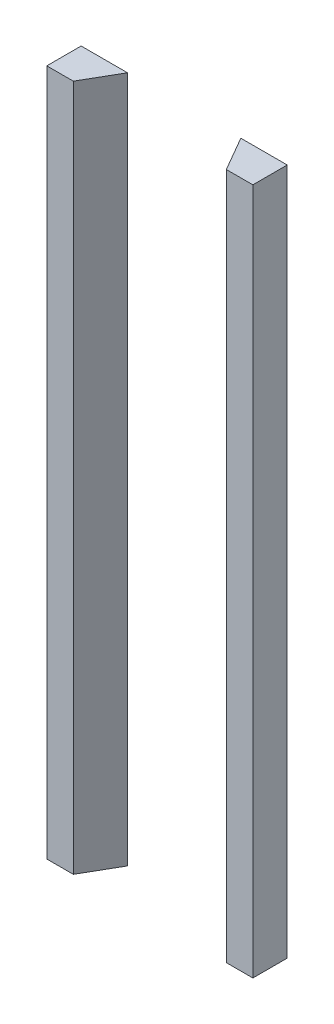
ISO-10303-21;
HEADER;
FILE_DESCRIPTION(('STEP AP214'),'2;1');
FILE_NAME('part.step','',(''),(''),'','','');
FILE_SCHEMA(('AUTOMOTIVE_DESIGN { 1 0 10303 214 1 1 1 1 }'));
ENDSEC;
DATA;
#1=APPLICATION_CONTEXT('core data for automotive mechanical design processes');
#2=APPLICATION_PROTOCOL_DEFINITION('international standard','automotive_design',2000,#1);
#3=PRODUCT_CONTEXT('',#1,'mechanical');
#4=PRODUCT('Part','Part','',(#3));
#5=PRODUCT_RELATED_PRODUCT_CATEGORY('part','',(#4));
#6=PRODUCT_DEFINITION_FORMATION('','',#4);
#7=PRODUCT_DEFINITION_CONTEXT('part definition',#1,'design');
#8=PRODUCT_DEFINITION('design','',#6,#7);
#9=PRODUCT_DEFINITION_SHAPE('','',#8);
#10=(LENGTH_UNIT() NAMED_UNIT(*) SI_UNIT(.MILLI.,.METRE.));
#11=(NAMED_UNIT(*) PLANE_ANGLE_UNIT() SI_UNIT($,.RADIAN.));
#12=(NAMED_UNIT(*) SI_UNIT($,.STERADIAN.) SOLID_ANGLE_UNIT());
#13=UNCERTAINTY_MEASURE_WITH_UNIT(LENGTH_MEASURE(1.E-05),#10,'distance_accuracy_value','');
#14=(GEOMETRIC_REPRESENTATION_CONTEXT(3) GLOBAL_UNCERTAINTY_ASSIGNED_CONTEXT((#13)) GLOBAL_UNIT_ASSIGNED_CONTEXT((#10,
#11,#12)) REPRESENTATION_CONTEXT('',''));
#15=CARTESIAN_POINT('',(0.,0.,0.));
#16=DIRECTION('',(0.,0.,1.));
#17=DIRECTION('',(1.,0.,0.));
#18=AXIS2_PLACEMENT_3D('',#15,#16,#17);
#19=CARTESIAN_POINT('',(-30.,200.,-4.99999999999999));
#20=DIRECTION('',(0.,0.,1.));
#21=DIRECTION('',(1.,0.,0.));
#22=AXIS2_PLACEMENT_3D('',#19,#20,#21);
#23=PLANE('',#22);
#24=DIRECTION('',(-1.,0.,0.));
#25=VECTOR('',#24,1.);
#26=CARTESIAN_POINT('',(-30.,200.,-4.99999999999999));
#27=LINE('',#26,#25);
#28=CARTESIAN_POINT('',(-16.5,200.,-4.99999999999999));
#29=VERTEX_POINT('',#28);
#30=CARTESIAN_POINT('',(-30.,200.,-4.99999999999999));
#31=VERTEX_POINT('',#30);
#32=EDGE_CURVE('E91',#29,#31,#27,.T.);
#33=ORIENTED_EDGE('',*,*,#32,.F.);
#34=DIRECTION('',(0.,1.,0.));
#35=VECTOR('',#34,1.);
#36=CARTESIAN_POINT('',(-16.5,-0.001000000000001,-4.99999999999999));
#37=LINE('',#36,#35);
#38=CARTESIAN_POINT('',(-16.5,0.,-4.99999999999999));
#39=VERTEX_POINT('',#38);
#40=EDGE_CURVE('E55',#39,#29,#37,.T.);
#41=ORIENTED_EDGE('',*,*,#40,.F.);
#42=DIRECTION('',(-1.,0.,0.));
#43=VECTOR('',#42,1.);
#44=CARTESIAN_POINT('',(-30.,0.,-4.99999999999999));
#45=LINE('',#44,#43);
#46=CARTESIAN_POINT('',(-30.,0.,-4.99999999999999));
#47=VERTEX_POINT('',#46);
#48=EDGE_CURVE('E49',#39,#47,#45,.T.);
#49=ORIENTED_EDGE('',*,*,#48,.T.);
#50=DIRECTION('',(0.,-1.,0.));
#51=VECTOR('',#50,1.);
#52=CARTESIAN_POINT('',(-30.,200.,-4.99999999999999));
#53=LINE('',#52,#51);
#54=EDGE_CURVE('E96',#31,#47,#53,.T.);
#55=ORIENTED_EDGE('',*,*,#54,.F.);
#56=EDGE_LOOP('',(#33,#41,#49,#55));
#57=FACE_BOUND('',#56,.T.);
#58=ADVANCED_FACE('F46',(#57),#23,.F.);
#59=CARTESIAN_POINT('',(-30.,200.,5.));
#60=DIRECTION('',(0.,0.,-1.));
#61=DIRECTION('',(-1.,0.,0.));
#62=AXIS2_PLACEMENT_3D('',#59,#60,#61);
#63=PLANE('',#62);
#64=DIRECTION('',(1.,0.,0.));
#65=VECTOR('',#64,1.);
#66=CARTESIAN_POINT('',(-30.,0.,5.));
#67=LINE('',#66,#65);
#68=CARTESIAN_POINT('',(-30.,0.,5.));
#69=VERTEX_POINT('',#68);
#70=CARTESIAN_POINT('',(-22.2735026918963,0.,5.00000000000001));
#71=VERTEX_POINT('',#70);
#72=EDGE_CURVE('E106',#69,#71,#67,.T.);
#73=ORIENTED_EDGE('',*,*,#72,.T.);
#74=DIRECTION('',(0.,1.,0.));
#75=VECTOR('',#74,1.);
#76=CARTESIAN_POINT('',(-22.2735026918963,-0.001000000000001,5.00000000000001));
#77=LINE('',#76,#75);
#78=CARTESIAN_POINT('',(-22.2735026918963,200.,5.00000000000001));
#79=VERTEX_POINT('',#78);
#80=EDGE_CURVE('E63',#71,#79,#77,.T.);
#81=ORIENTED_EDGE('',*,*,#80,.T.);
#82=DIRECTION('',(1.,0.,0.));
#83=VECTOR('',#82,1.);
#84=CARTESIAN_POINT('',(-30.,200.,5.));
#85=LINE('',#84,#83);
#86=CARTESIAN_POINT('',(-30.,200.,5.));
#87=VERTEX_POINT('',#86);
#88=EDGE_CURVE('E94',#87,#79,#85,.T.);
#89=ORIENTED_EDGE('',*,*,#88,.F.);
#90=DIRECTION('',(0.,-1.,0.));
#91=VECTOR('',#90,1.);
#92=CARTESIAN_POINT('',(-30.,200.,5.));
#93=LINE('',#92,#91);
#94=EDGE_CURVE('E99',#87,#69,#93,.T.);
#95=ORIENTED_EDGE('',*,*,#94,.T.);
#96=EDGE_LOOP('',(#73,#81,#89,#95));
#97=FACE_BOUND('',#96,.T.);
#98=ADVANCED_FACE('F127',(#97),#63,.F.);
#99=CARTESIAN_POINT('',(0.,200.,0.));
#100=DIRECTION('',(0.,1.,0.));
#101=DIRECTION('',(0.,0.,1.));
#102=AXIS2_PLACEMENT_3D('',#99,#100,#101);
#103=PLANE('',#102);
#104=DIRECTION('',(-0.500000000000004,0.,0.866025403784436));
#105=VECTOR('',#104,1.);
#106=CARTESIAN_POINT('',(-22.2735026918963,200.,5.00000000000001));
#107=LINE('',#106,#105);
#108=EDGE_CURVE('E12',#29,#79,#107,.T.);
#109=ORIENTED_EDGE('',*,*,#108,.F.);
#110=ORIENTED_EDGE('',*,*,#32,.T.);
#111=DIRECTION('',(0.,0.,1.));
#112=VECTOR('',#111,1.);
#113=CARTESIAN_POINT('',(-30.,200.,-4.99999999999999));
#114=LINE('',#113,#112);
#115=EDGE_CURVE('E98',#31,#87,#114,.T.);
#116=ORIENTED_EDGE('',*,*,#115,.T.);
#117=ORIENTED_EDGE('',*,*,#88,.T.);
#118=EDGE_LOOP('',(#109,#110,#116,#117));
#119=FACE_BOUND('',#118,.T.);
#120=ADVANCED_FACE('F90',(#119),#103,.T.);
#121=CARTESIAN_POINT('',(0.,0.,0.));
#122=DIRECTION('',(0.,1.,0.));
#123=DIRECTION('',(0.,0.,1.));
#124=AXIS2_PLACEMENT_3D('',#121,#122,#123);
#125=PLANE('',#124);
#126=ORIENTED_EDGE('',*,*,#48,.F.);
#127=DIRECTION('',(0.500000000000004,0.,-0.866025403784436));
#128=VECTOR('',#127,1.);
#129=CARTESIAN_POINT('',(-22.2735026918963,0.,5.00000000000001));
#130=LINE('',#129,#128);
#131=EDGE_CURVE('E80',#71,#39,#130,.T.);
#132=ORIENTED_EDGE('',*,*,#131,.F.);
#133=ORIENTED_EDGE('',*,*,#72,.F.);
#134=DIRECTION('',(0.,0.,1.));
#135=VECTOR('',#134,1.);
#136=CARTESIAN_POINT('',(-30.,0.,-4.99999999999999));
#137=LINE('',#136,#135);
#138=EDGE_CURVE('E116',#47,#69,#137,.T.);
#139=ORIENTED_EDGE('',*,*,#138,.F.);
#140=EDGE_LOOP('',(#126,#132,#133,#139));
#141=FACE_BOUND('',#140,.T.);
#142=ADVANCED_FACE('F118',(#141),#125,.F.);
#143=CARTESIAN_POINT('',(-30.,200.,-4.99999999999999));
#144=DIRECTION('',(1.,0.,0.));
#145=DIRECTION('',(0.,0.,-1.));
#146=AXIS2_PLACEMENT_3D('',#143,#144,#145);
#147=PLANE('',#146);
#148=ORIENTED_EDGE('',*,*,#138,.T.);
#149=ORIENTED_EDGE('',*,*,#94,.F.);
#150=ORIENTED_EDGE('',*,*,#115,.F.);
#151=ORIENTED_EDGE('',*,*,#54,.T.);
#152=EDGE_LOOP('',(#148,#149,#150,#151));
#153=FACE_BOUND('',#152,.T.);
#154=ADVANCED_FACE('F114',(#153),#147,.F.);
#155=CARTESIAN_POINT('',(-22.2735026918963,-0.001000000000001,5.00000000000001));
#156=DIRECTION('',(-0.866025403784436,0.,-0.500000000000004));
#157=DIRECTION('',(-0.500000000000004,0.,0.866025403784436));
#158=AXIS2_PLACEMENT_3D('',#155,#156,#157);
#159=PLANE('',#158);
#160=ORIENTED_EDGE('',*,*,#131,.T.);
#161=ORIENTED_EDGE('',*,*,#40,.T.);
#162=ORIENTED_EDGE('',*,*,#108,.T.);
#163=ORIENTED_EDGE('',*,*,#80,.F.);
#164=EDGE_LOOP('',(#160,#161,#162,#163));
#165=FACE_BOUND('',#164,.T.);
#166=ADVANCED_FACE('F83',(#165),#159,.F.);
#167=CLOSED_SHELL('',(#58,#98,#120,#142,#154,#166));
#168=MANIFOLD_SOLID_BREP('B2',#167);
#169=CARTESIAN_POINT('',(30.,200.,-4.99999999999999));
#170=DIRECTION('',(-1.,0.,0.));
#171=DIRECTION('',(0.,0.,1.));
#172=AXIS2_PLACEMENT_3D('',#169,#170,#171);
#173=PLANE('',#172);
#174=DIRECTION('',(0.,0.,-1.));
#175=VECTOR('',#174,1.);
#176=CARTESIAN_POINT('',(30.,0.,-4.99999999999999));
#177=LINE('',#176,#175);
#178=CARTESIAN_POINT('',(30.,0.,5.));
#179=VERTEX_POINT('',#178);
#180=CARTESIAN_POINT('',(30.,0.,-4.99999999999999));
#181=VERTEX_POINT('',#180);
#182=EDGE_CURVE('E221',#179,#181,#177,.T.);
#183=ORIENTED_EDGE('',*,*,#182,.T.);
#184=DIRECTION('',(0.,-1.,0.));
#185=VECTOR('',#184,1.);
#186=CARTESIAN_POINT('',(30.,200.,-4.99999999999999));
#187=LINE('',#186,#185);
#188=CARTESIAN_POINT('',(30.,200.,-4.99999999999999));
#189=VERTEX_POINT('',#188);
#190=EDGE_CURVE('E44',#189,#181,#187,.T.);
#191=ORIENTED_EDGE('',*,*,#190,.F.);
#192=DIRECTION('',(0.,0.,-1.));
#193=VECTOR('',#192,1.);
#194=CARTESIAN_POINT('',(30.,200.,-4.99999999999999));
#195=LINE('',#194,#193);
#196=CARTESIAN_POINT('',(30.,200.,5.));
#197=VERTEX_POINT('',#196);
#198=EDGE_CURVE('E215',#197,#189,#195,.T.);
#199=ORIENTED_EDGE('',*,*,#198,.F.);
#200=DIRECTION('',(0.,-1.,0.));
#201=VECTOR('',#200,1.);
#202=CARTESIAN_POINT('',(30.,200.,5.));
#203=LINE('',#202,#201);
#204=EDGE_CURVE('E176',#197,#179,#203,.T.);
#205=ORIENTED_EDGE('',*,*,#204,.T.);
#206=EDGE_LOOP('',(#183,#191,#199,#205));
#207=FACE_BOUND('',#206,.T.);
#208=ADVANCED_FACE('F169',(#207),#173,.F.);
#209=CARTESIAN_POINT('',(0.,0.,0.));
#210=DIRECTION('',(0.,1.,0.));
#211=DIRECTION('',(0.,0.,1.));
#212=AXIS2_PLACEMENT_3D('',#209,#210,#211);
#213=PLANE('',#212);
#214=DIRECTION('',(1.,0.,0.));
#215=VECTOR('',#214,1.);
#216=CARTESIAN_POINT('',(-30.,0.,5.));
#217=LINE('',#216,#215);
#218=CARTESIAN_POINT('',(22.2735026918963,0.,5.));
#219=VERTEX_POINT('',#218);
#220=EDGE_CURVE('E206',#219,#179,#217,.T.);
#221=ORIENTED_EDGE('',*,*,#220,.F.);
#222=DIRECTION('',(0.500000000000004,0.,0.866025403784436));
#223=VECTOR('',#222,1.);
#224=CARTESIAN_POINT('',(16.5,0.,-4.99999999999999));
#225=LINE('',#224,#223);
#226=CARTESIAN_POINT('',(16.5,0.,-4.99999999999999));
#227=VERTEX_POINT('',#226);
#228=EDGE_CURVE('E224',#227,#219,#225,.T.);
#229=ORIENTED_EDGE('',*,*,#228,.F.);
#230=DIRECTION('',(-1.,0.,0.));
#231=VECTOR('',#230,1.);
#232=CARTESIAN_POINT('',(-30.,0.,-4.99999999999999));
#233=LINE('',#232,#231);
#234=EDGE_CURVE('E216',#181,#227,#233,.T.);
#235=ORIENTED_EDGE('',*,*,#234,.F.);
#236=ORIENTED_EDGE('',*,*,#182,.F.);
#237=EDGE_LOOP('',(#221,#229,#235,#236));
#238=FACE_BOUND('',#237,.T.);
#239=ADVANCED_FACE('F222',(#238),#213,.F.);
#240=CARTESIAN_POINT('',(0.,200.,0.));
#241=DIRECTION('',(0.,1.,0.));
#242=DIRECTION('',(0.,0.,1.));
#243=AXIS2_PLACEMENT_3D('',#240,#241,#242);
#244=PLANE('',#243);
#245=DIRECTION('',(-0.500000000000004,0.,-0.866025403784436));
#246=VECTOR('',#245,1.);
#247=CARTESIAN_POINT('',(16.5,200.,-4.99999999999999));
#248=LINE('',#247,#246);
#249=CARTESIAN_POINT('',(22.2735026918963,200.,5.));
#250=VERTEX_POINT('',#249);
#251=CARTESIAN_POINT('',(16.5,200.,-4.99999999999999));
#252=VERTEX_POINT('',#251);
#253=EDGE_CURVE('E235',#250,#252,#248,.T.);
#254=ORIENTED_EDGE('',*,*,#253,.F.);
#255=DIRECTION('',(1.,0.,0.));
#256=VECTOR('',#255,1.);
#257=CARTESIAN_POINT('',(-30.,200.,5.));
#258=LINE('',#257,#256);
#259=EDGE_CURVE('E192',#250,#197,#258,.T.);
#260=ORIENTED_EDGE('',*,*,#259,.T.);
#261=ORIENTED_EDGE('',*,*,#198,.T.);
#262=DIRECTION('',(-1.,0.,0.));
#263=VECTOR('',#262,1.);
#264=CARTESIAN_POINT('',(-30.,200.,-4.99999999999999));
#265=LINE('',#264,#263);
#266=EDGE_CURVE('E230',#189,#252,#265,.T.);
#267=ORIENTED_EDGE('',*,*,#266,.T.);
#268=EDGE_LOOP('',(#254,#260,#261,#267));
#269=FACE_BOUND('',#268,.T.);
#270=ADVANCED_FACE('F241',(#269),#244,.T.);
#271=CARTESIAN_POINT('',(-30.,200.,5.));
#272=DIRECTION('',(0.,0.,-1.));
#273=DIRECTION('',(-1.,0.,0.));
#274=AXIS2_PLACEMENT_3D('',#271,#272,#273);
#275=PLANE('',#274);
#276=ORIENTED_EDGE('',*,*,#259,.F.);
#277=DIRECTION('',(0.,1.,0.));
#278=VECTOR('',#277,1.);
#279=CARTESIAN_POINT('',(22.2735026918963,-0.001000000000001,5.));
#280=LINE('',#279,#278);
#281=EDGE_CURVE('E212',#219,#250,#280,.T.);
#282=ORIENTED_EDGE('',*,*,#281,.F.);
#283=ORIENTED_EDGE('',*,*,#220,.T.);
#284=ORIENTED_EDGE('',*,*,#204,.F.);
#285=EDGE_LOOP('',(#276,#282,#283,#284));
#286=FACE_BOUND('',#285,.T.);
#287=ADVANCED_FACE('F208',(#286),#275,.F.);
#288=CARTESIAN_POINT('',(-30.,200.,-4.99999999999999));
#289=DIRECTION('',(0.,0.,1.));
#290=DIRECTION('',(1.,0.,0.));
#291=AXIS2_PLACEMENT_3D('',#288,#289,#290);
#292=PLANE('',#291);
#293=ORIENTED_EDGE('',*,*,#234,.T.);
#294=DIRECTION('',(0.,1.,0.));
#295=VECTOR('',#294,1.);
#296=CARTESIAN_POINT('',(16.5,-0.001000000000001,-4.99999999999999));
#297=LINE('',#296,#295);
#298=EDGE_CURVE('E183',#227,#252,#297,.T.);
#299=ORIENTED_EDGE('',*,*,#298,.T.);
#300=ORIENTED_EDGE('',*,*,#266,.F.);
#301=ORIENTED_EDGE('',*,*,#190,.T.);
#302=EDGE_LOOP('',(#293,#299,#300,#301));
#303=FACE_BOUND('',#302,.T.);
#304=ADVANCED_FACE('F240',(#303),#292,.F.);
#305=CARTESIAN_POINT('',(16.5,-0.001000000000001,-4.99999999999999));
#306=DIRECTION('',(0.866025403784436,0.,-0.500000000000004));
#307=DIRECTION('',(-0.500000000000004,0.,-0.866025403784436));
#308=AXIS2_PLACEMENT_3D('',#305,#306,#307);
#309=PLANE('',#308);
#310=ORIENTED_EDGE('',*,*,#228,.T.);
#311=ORIENTED_EDGE('',*,*,#281,.T.);
#312=ORIENTED_EDGE('',*,*,#253,.T.);
#313=ORIENTED_EDGE('',*,*,#298,.F.);
#314=EDGE_LOOP('',(#310,#311,#312,#313));
#315=FACE_BOUND('',#314,.T.);
#316=ADVANCED_FACE('F237',(#315),#309,.F.);
#317=CLOSED_SHELL('',(#208,#239,#270,#287,#304,#316));
#318=MANIFOLD_SOLID_BREP('B6',#317);
#319=ADVANCED_BREP_SHAPE_REPRESENTATION('',(#18,#168,#318),#14);
#320=SHAPE_DEFINITION_REPRESENTATION(#9,#319);
ENDSEC;
END-ISO-10303-21;
